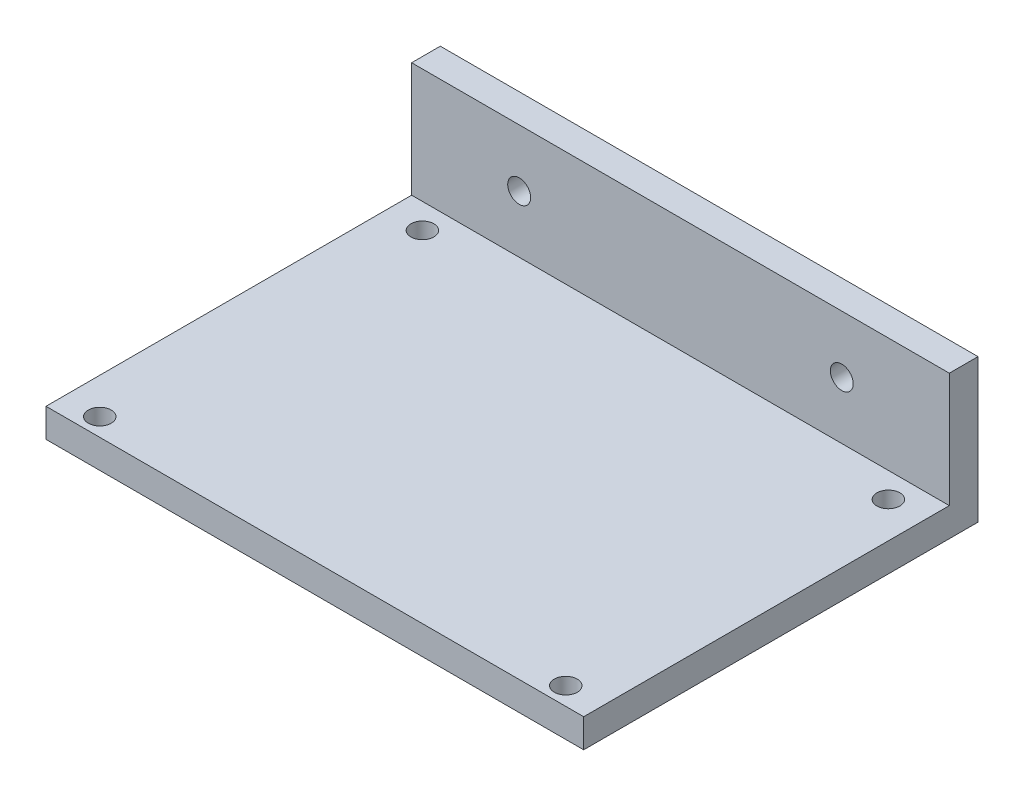
ISO-10303-21;
HEADER;
FILE_DESCRIPTION(('STEP AP214'),'2;1');
FILE_NAME('part.step','',(''),(''),'','','');
FILE_SCHEMA(('AUTOMOTIVE_DESIGN { 1 0 10303 214 1 1 1 1 }'));
ENDSEC;
DATA;
#1=APPLICATION_CONTEXT('core data for automotive mechanical design processes');
#2=APPLICATION_PROTOCOL_DEFINITION('international standard','automotive_design',2000,#1);
#3=PRODUCT_CONTEXT('',#1,'mechanical');
#4=PRODUCT('Part','Part','',(#3));
#5=PRODUCT_RELATED_PRODUCT_CATEGORY('part','',(#4));
#6=PRODUCT_DEFINITION_FORMATION('','',#4);
#7=PRODUCT_DEFINITION_CONTEXT('part definition',#1,'design');
#8=PRODUCT_DEFINITION('design','',#6,#7);
#9=PRODUCT_DEFINITION_SHAPE('','',#8);
#10=(LENGTH_UNIT() NAMED_UNIT(*) SI_UNIT(.MILLI.,.METRE.));
#11=(NAMED_UNIT(*) PLANE_ANGLE_UNIT() SI_UNIT($,.RADIAN.));
#12=(NAMED_UNIT(*) SI_UNIT($,.STERADIAN.) SOLID_ANGLE_UNIT());
#13=UNCERTAINTY_MEASURE_WITH_UNIT(LENGTH_MEASURE(1.E-05),#10,'distance_accuracy_value','');
#14=(GEOMETRIC_REPRESENTATION_CONTEXT(3) GLOBAL_UNCERTAINTY_ASSIGNED_CONTEXT((#13)) GLOBAL_UNIT_ASSIGNED_CONTEXT((#10,
#11,#12)) REPRESENTATION_CONTEXT('',''));
#15=CARTESIAN_POINT('',(0.,0.,0.));
#16=DIRECTION('',(0.,0.,1.));
#17=DIRECTION('',(1.,0.,0.));
#18=AXIS2_PLACEMENT_3D('',#15,#16,#17);
#19=CARTESIAN_POINT('',(0.,20.,0.));
#20=DIRECTION('',(1.,0.,0.));
#21=DIRECTION('',(0.,0.,-1.));
#22=AXIS2_PLACEMENT_3D('',#19,#20,#21);
#23=PLANE('',#22);
#24=DIRECTION('',(0.,0.,-1.));
#25=VECTOR('',#24,1.);
#26=CARTESIAN_POINT('',(0.,4.,0.));
#27=LINE('',#26,#25);
#28=CARTESIAN_POINT('',(0.,4.,0.));
#29=VERTEX_POINT('',#28);
#30=CARTESIAN_POINT('',(0.,4.,-51.));
#31=VERTEX_POINT('',#30);
#32=EDGE_CURVE('E104',#29,#31,#27,.T.);
#33=ORIENTED_EDGE('',*,*,#32,.T.);
#34=DIRECTION('',(0.,1.,0.));
#35=VECTOR('',#34,1.);
#36=CARTESIAN_POINT('',(0.,20.,-51.));
#37=LINE('',#36,#35);
#38=CARTESIAN_POINT('',(0.,20.,-51.));
#39=VERTEX_POINT('',#38);
#40=EDGE_CURVE('E107',#31,#39,#37,.T.);
#41=ORIENTED_EDGE('',*,*,#40,.T.);
#42=DIRECTION('',(0.,0.,1.));
#43=VECTOR('',#42,1.);
#44=CARTESIAN_POINT('',(0.,20.,0.));
#45=LINE('',#44,#43);
#46=CARTESIAN_POINT('',(0.,20.,-55.));
#47=VERTEX_POINT('',#46);
#48=EDGE_CURVE('E90',#47,#39,#45,.T.);
#49=ORIENTED_EDGE('',*,*,#48,.F.);
#50=DIRECTION('',(0.,-1.,0.));
#51=VECTOR('',#50,1.);
#52=CARTESIAN_POINT('',(0.,20.,-55.));
#53=LINE('',#52,#51);
#54=CARTESIAN_POINT('',(0.,0.,-55.));
#55=VERTEX_POINT('',#54);
#56=EDGE_CURVE('E83',#47,#55,#53,.T.);
#57=ORIENTED_EDGE('',*,*,#56,.T.);
#58=DIRECTION('',(0.,0.,1.));
#59=VECTOR('',#58,1.);
#60=CARTESIAN_POINT('',(0.,0.,0.));
#61=LINE('',#60,#59);
#62=CARTESIAN_POINT('',(0.,0.,0.));
#63=VERTEX_POINT('',#62);
#64=EDGE_CURVE('E97',#55,#63,#61,.T.);
#65=ORIENTED_EDGE('',*,*,#64,.T.);
#66=DIRECTION('',(0.,-1.,0.));
#67=VECTOR('',#66,1.);
#68=CARTESIAN_POINT('',(0.,20.,0.));
#69=LINE('',#68,#67);
#70=EDGE_CURVE('E45',#29,#63,#69,.T.);
#71=ORIENTED_EDGE('',*,*,#70,.F.);
#72=EDGE_LOOP('',(#33,#41,#49,#57,#65,#71));
#73=FACE_BOUND('',#72,.T.);
#74=ADVANCED_FACE('F37',(#73),#23,.F.);
#75=CARTESIAN_POINT('',(0.,20.,0.));
#76=DIRECTION('',(0.,0.,-1.));
#77=DIRECTION('',(-1.,0.,0.));
#78=AXIS2_PLACEMENT_3D('',#75,#76,#77);
#79=PLANE('',#78);
#80=DIRECTION('',(0.,-1.,0.));
#81=VECTOR('',#80,1.);
#82=CARTESIAN_POINT('',(75.,20.,0.));
#83=LINE('',#82,#81);
#84=CARTESIAN_POINT('',(75.,4.,0.));
#85=VERTEX_POINT('',#84);
#86=CARTESIAN_POINT('',(75.,0.,0.));
#87=VERTEX_POINT('',#86);
#88=EDGE_CURVE('E114',#85,#87,#83,.T.);
#89=ORIENTED_EDGE('',*,*,#88,.F.);
#90=DIRECTION('',(1.,0.,0.));
#91=VECTOR('',#90,1.);
#92=CARTESIAN_POINT('',(-19.,4.,0.));
#93=LINE('',#92,#91);
#94=EDGE_CURVE('E150',#29,#85,#93,.T.);
#95=ORIENTED_EDGE('',*,*,#94,.F.);
#96=ORIENTED_EDGE('',*,*,#70,.T.);
#97=DIRECTION('',(1.,0.,0.));
#98=VECTOR('',#97,1.);
#99=CARTESIAN_POINT('',(0.,0.,0.));
#100=LINE('',#99,#98);
#101=EDGE_CURVE('E103',#63,#87,#100,.T.);
#102=ORIENTED_EDGE('',*,*,#101,.T.);
#103=EDGE_LOOP('',(#89,#95,#96,#102));
#104=FACE_BOUND('',#103,.T.);
#105=ADVANCED_FACE('F166',(#104),#79,.F.);
#106=CARTESIAN_POINT('',(75.,20.,0.));
#107=DIRECTION('',(-1.,0.,0.));
#108=DIRECTION('',(0.,0.,1.));
#109=AXIS2_PLACEMENT_3D('',#106,#107,#108);
#110=PLANE('',#109);
#111=DIRECTION('',(0.,0.,-1.));
#112=VECTOR('',#111,1.);
#113=CARTESIAN_POINT('',(75.,20.,0.));
#114=LINE('',#113,#112);
#115=CARTESIAN_POINT('',(75.,20.,-51.));
#116=VERTEX_POINT('',#115);
#117=CARTESIAN_POINT('',(75.,20.,-55.));
#118=VERTEX_POINT('',#117);
#119=EDGE_CURVE('E156',#116,#118,#114,.T.);
#120=ORIENTED_EDGE('',*,*,#119,.F.);
#121=DIRECTION('',(0.,1.,0.));
#122=VECTOR('',#121,1.);
#123=CARTESIAN_POINT('',(75.,20.,-51.));
#124=LINE('',#123,#122);
#125=CARTESIAN_POINT('',(75.,4.,-51.));
#126=VERTEX_POINT('',#125);
#127=EDGE_CURVE('E53',#126,#116,#124,.T.);
#128=ORIENTED_EDGE('',*,*,#127,.F.);
#129=DIRECTION('',(0.,0.,-1.));
#130=VECTOR('',#129,1.);
#131=CARTESIAN_POINT('',(75.,4.,0.));
#132=LINE('',#131,#130);
#133=EDGE_CURVE('E124',#85,#126,#132,.T.);
#134=ORIENTED_EDGE('',*,*,#133,.F.);
#135=ORIENTED_EDGE('',*,*,#88,.T.);
#136=DIRECTION('',(0.,0.,-1.));
#137=VECTOR('',#136,1.);
#138=CARTESIAN_POINT('',(75.,0.,0.));
#139=LINE('',#138,#137);
#140=CARTESIAN_POINT('',(75.,0.,-55.));
#141=VERTEX_POINT('',#140);
#142=EDGE_CURVE('E91',#87,#141,#139,.T.);
#143=ORIENTED_EDGE('',*,*,#142,.T.);
#144=DIRECTION('',(0.,-1.,0.));
#145=VECTOR('',#144,1.);
#146=CARTESIAN_POINT('',(75.,20.,-55.));
#147=LINE('',#146,#145);
#148=EDGE_CURVE('E86',#118,#141,#147,.T.);
#149=ORIENTED_EDGE('',*,*,#148,.F.);
#150=EDGE_LOOP('',(#120,#128,#134,#135,#143,#149));
#151=FACE_BOUND('',#150,.T.);
#152=ADVANCED_FACE('F160',(#151),#110,.F.);
#153=CARTESIAN_POINT('',(0.,20.,-55.));
#154=DIRECTION('',(0.,0.,1.));
#155=DIRECTION('',(1.,0.,0.));
#156=AXIS2_PLACEMENT_3D('',#153,#154,#155);
#157=PLANE('',#156);
#158=CARTESIAN_POINT('',(60.,12.,-55.));
#159=DIRECTION('',(0.,0.,-1.));
#160=DIRECTION('',(-1.,0.,0.));
#161=AXIS2_PLACEMENT_3D('',#158,#159,#160);
#162=CIRCLE('',#161,1.6);
#163=CARTESIAN_POINT('',(58.4,12.,-55.));
#164=VERTEX_POINT('',#163);
#165=EDGE_CURVE('E121',#164,#164,#162,.T.);
#166=ORIENTED_EDGE('',*,*,#165,.F.);
#167=EDGE_LOOP('',(#166));
#168=FACE_BOUND('',#167,.T.);
#169=CARTESIAN_POINT('',(15.,12.,-55.));
#170=DIRECTION('',(0.,0.,-1.));
#171=DIRECTION('',(-1.,0.,0.));
#172=AXIS2_PLACEMENT_3D('',#169,#170,#171);
#173=CIRCLE('',#172,1.6);
#174=CARTESIAN_POINT('',(13.4,12.,-55.));
#175=VERTEX_POINT('',#174);
#176=EDGE_CURVE('E136',#175,#175,#173,.T.);
#177=ORIENTED_EDGE('',*,*,#176,.F.);
#178=EDGE_LOOP('',(#177));
#179=FACE_BOUND('',#178,.T.);
#180=DIRECTION('',(-1.,0.,0.));
#181=VECTOR('',#180,1.);
#182=CARTESIAN_POINT('',(0.,0.,-55.));
#183=LINE('',#182,#181);
#184=EDGE_CURVE('E80',#141,#55,#183,.T.);
#185=ORIENTED_EDGE('',*,*,#184,.T.);
#186=ORIENTED_EDGE('',*,*,#56,.F.);
#187=DIRECTION('',(-1.,0.,0.));
#188=VECTOR('',#187,1.);
#189=CARTESIAN_POINT('',(0.,20.,-55.));
#190=LINE('',#189,#188);
#191=EDGE_CURVE('E61',#118,#47,#190,.T.);
#192=ORIENTED_EDGE('',*,*,#191,.F.);
#193=ORIENTED_EDGE('',*,*,#148,.T.);
#194=EDGE_LOOP('',(#185,#186,#192,#193));
#195=FACE_BOUND('',#194,.T.);
#196=ADVANCED_FACE('F82',(#168,#179,#195),#157,.F.);
#197=CARTESIAN_POINT('',(0.,20.,0.));
#198=DIRECTION('',(0.,-1.,0.));
#199=DIRECTION('',(0.,0.,-1.));
#200=AXIS2_PLACEMENT_3D('',#197,#198,#199);
#201=PLANE('',#200);
#202=ORIENTED_EDGE('',*,*,#48,.T.);
#203=DIRECTION('',(1.,0.,0.));
#204=VECTOR('',#203,1.);
#205=CARTESIAN_POINT('',(0.,20.,-51.));
#206=LINE('',#205,#204);
#207=EDGE_CURVE('E11',#39,#116,#206,.T.);
#208=ORIENTED_EDGE('',*,*,#207,.T.);
#209=ORIENTED_EDGE('',*,*,#119,.T.);
#210=ORIENTED_EDGE('',*,*,#191,.T.);
#211=EDGE_LOOP('',(#202,#208,#209,#210));
#212=FACE_BOUND('',#211,.T.);
#213=ADVANCED_FACE('F158',(#212),#201,.F.);
#214=CARTESIAN_POINT('',(0.,0.,0.));
#215=DIRECTION('',(0.,-1.,0.));
#216=DIRECTION('',(0.,0.,-1.));
#217=AXIS2_PLACEMENT_3D('',#214,#215,#216);
#218=PLANE('',#217);
#219=CARTESIAN_POINT('',(70.,0.,-2.5));
#220=DIRECTION('',(0.,-1.,0.));
#221=DIRECTION('',(0.,0.,-1.));
#222=AXIS2_PLACEMENT_3D('',#219,#220,#221);
#223=CIRCLE('',#222,1.60000000000001);
#224=CARTESIAN_POINT('',(70.,0.,-4.10000000000001));
#225=VERTEX_POINT('',#224);
#226=EDGE_CURVE('E312',#225,#225,#223,.T.);
#227=ORIENTED_EDGE('',*,*,#226,.F.);
#228=EDGE_LOOP('',(#227));
#229=FACE_BOUND('',#228,.T.);
#230=CARTESIAN_POINT('',(70.,0.,-47.5));
#231=DIRECTION('',(0.,-1.,0.));
#232=DIRECTION('',(0.,0.,-1.));
#233=AXIS2_PLACEMENT_3D('',#230,#231,#232);
#234=CIRCLE('',#233,1.60000000000001);
#235=CARTESIAN_POINT('',(70.,0.,-49.1));
#236=VERTEX_POINT('',#235);
#237=EDGE_CURVE('E313',#236,#236,#234,.T.);
#238=ORIENTED_EDGE('',*,*,#237,.F.);
#239=EDGE_LOOP('',(#238));
#240=FACE_BOUND('',#239,.T.);
#241=CARTESIAN_POINT('',(5.,0.,-47.5));
#242=DIRECTION('',(0.,-1.,0.));
#243=DIRECTION('',(0.,0.,-1.));
#244=AXIS2_PLACEMENT_3D('',#241,#242,#243);
#245=CIRCLE('',#244,1.6);
#246=CARTESIAN_POINT('',(5.,0.,-49.1));
#247=VERTEX_POINT('',#246);
#248=EDGE_CURVE('E316',#247,#247,#245,.T.);
#249=ORIENTED_EDGE('',*,*,#248,.F.);
#250=EDGE_LOOP('',(#249));
#251=FACE_BOUND('',#250,.T.);
#252=CARTESIAN_POINT('',(5.,0.,-2.5));
#253=DIRECTION('',(0.,-1.,0.));
#254=DIRECTION('',(0.,0.,-1.));
#255=AXIS2_PLACEMENT_3D('',#252,#253,#254);
#256=CIRCLE('',#255,1.6);
#257=CARTESIAN_POINT('',(5.,0.,-4.1));
#258=VERTEX_POINT('',#257);
#259=EDGE_CURVE('E129',#258,#258,#256,.T.);
#260=ORIENTED_EDGE('',*,*,#259,.F.);
#261=EDGE_LOOP('',(#260));
#262=FACE_BOUND('',#261,.T.);
#263=ORIENTED_EDGE('',*,*,#64,.F.);
#264=ORIENTED_EDGE('',*,*,#184,.F.);
#265=ORIENTED_EDGE('',*,*,#142,.F.);
#266=ORIENTED_EDGE('',*,*,#101,.F.);
#267=EDGE_LOOP('',(#263,#264,#265,#266));
#268=FACE_BOUND('',#267,.T.);
#269=ADVANCED_FACE('F101',(#229,#240,#251,#262,#268),#218,.T.);
#270=CARTESIAN_POINT('',(-19.,4.,0.));
#271=DIRECTION('',(0.,-1.,0.));
#272=DIRECTION('',(0.,0.,-1.));
#273=AXIS2_PLACEMENT_3D('',#270,#271,#272);
#274=PLANE('',#273);
#275=CARTESIAN_POINT('',(70.,4.,-2.5));
#276=DIRECTION('',(0.,-1.,0.));
#277=DIRECTION('',(0.,0.,-1.));
#278=AXIS2_PLACEMENT_3D('',#275,#276,#277);
#279=CIRCLE('',#278,1.60000000000001);
#280=CARTESIAN_POINT('',(70.,4.,-4.10000000000001));
#281=VERTEX_POINT('',#280);
#282=EDGE_CURVE('E40',#281,#281,#279,.T.);
#283=ORIENTED_EDGE('',*,*,#282,.T.);
#284=EDGE_LOOP('',(#283));
#285=FACE_BOUND('',#284,.T.);
#286=CARTESIAN_POINT('',(70.,4.,-47.5));
#287=DIRECTION('',(0.,-1.,0.));
#288=DIRECTION('',(0.,0.,-1.));
#289=AXIS2_PLACEMENT_3D('',#286,#287,#288);
#290=CIRCLE('',#289,1.60000000000001);
#291=CARTESIAN_POINT('',(70.,4.,-49.1));
#292=VERTEX_POINT('',#291);
#293=EDGE_CURVE('E131',#292,#292,#290,.T.);
#294=ORIENTED_EDGE('',*,*,#293,.T.);
#295=EDGE_LOOP('',(#294));
#296=FACE_BOUND('',#295,.T.);
#297=CARTESIAN_POINT('',(5.,4.,-47.5));
#298=DIRECTION('',(0.,-1.,0.));
#299=DIRECTION('',(0.,0.,-1.));
#300=AXIS2_PLACEMENT_3D('',#297,#298,#299);
#301=CIRCLE('',#300,1.6);
#302=CARTESIAN_POINT('',(5.,4.,-49.1));
#303=VERTEX_POINT('',#302);
#304=EDGE_CURVE('E128',#303,#303,#301,.T.);
#305=ORIENTED_EDGE('',*,*,#304,.T.);
#306=EDGE_LOOP('',(#305));
#307=FACE_BOUND('',#306,.T.);
#308=CARTESIAN_POINT('',(5.,4.,-2.5));
#309=DIRECTION('',(0.,-1.,0.));
#310=DIRECTION('',(0.,0.,-1.));
#311=AXIS2_PLACEMENT_3D('',#308,#309,#310);
#312=CIRCLE('',#311,1.6);
#313=CARTESIAN_POINT('',(5.,4.,-4.1));
#314=VERTEX_POINT('',#313);
#315=EDGE_CURVE('E125',#314,#314,#312,.T.);
#316=ORIENTED_EDGE('',*,*,#315,.T.);
#317=EDGE_LOOP('',(#316));
#318=FACE_BOUND('',#317,.T.);
#319=ORIENTED_EDGE('',*,*,#94,.T.);
#320=ORIENTED_EDGE('',*,*,#133,.T.);
#321=DIRECTION('',(1.,0.,0.));
#322=VECTOR('',#321,1.);
#323=CARTESIAN_POINT('',(-19.,4.,-51.));
#324=LINE('',#323,#322);
#325=EDGE_CURVE('E151',#31,#126,#324,.T.);
#326=ORIENTED_EDGE('',*,*,#325,.F.);
#327=ORIENTED_EDGE('',*,*,#32,.F.);
#328=EDGE_LOOP('',(#319,#320,#326,#327));
#329=FACE_BOUND('',#328,.T.);
#330=ADVANCED_FACE('F178',(#285,#296,#307,#318,#329),#274,.F.);
#331=CARTESIAN_POINT('',(-19.,20.,-51.));
#332=DIRECTION('',(0.,0.,-1.));
#333=DIRECTION('',(-1.,0.,0.));
#334=AXIS2_PLACEMENT_3D('',#331,#332,#333);
#335=PLANE('',#334);
#336=CARTESIAN_POINT('',(60.,12.,-51.));
#337=DIRECTION('',(0.,0.,-1.));
#338=DIRECTION('',(-1.,0.,0.));
#339=AXIS2_PLACEMENT_3D('',#336,#337,#338);
#340=CIRCLE('',#339,1.6);
#341=CARTESIAN_POINT('',(58.4,12.,-51.));
#342=VERTEX_POINT('',#341);
#343=EDGE_CURVE('E120',#342,#342,#340,.T.);
#344=ORIENTED_EDGE('',*,*,#343,.T.);
#345=EDGE_LOOP('',(#344));
#346=FACE_BOUND('',#345,.T.);
#347=CARTESIAN_POINT('',(15.,12.,-51.));
#348=DIRECTION('',(0.,0.,-1.));
#349=DIRECTION('',(-1.,0.,0.));
#350=AXIS2_PLACEMENT_3D('',#347,#348,#349);
#351=CIRCLE('',#350,1.6);
#352=CARTESIAN_POINT('',(13.4,12.,-51.));
#353=VERTEX_POINT('',#352);
#354=EDGE_CURVE('E117',#353,#353,#351,.T.);
#355=ORIENTED_EDGE('',*,*,#354,.T.);
#356=EDGE_LOOP('',(#355));
#357=FACE_BOUND('',#356,.T.);
#358=ORIENTED_EDGE('',*,*,#325,.T.);
#359=ORIENTED_EDGE('',*,*,#127,.T.);
#360=ORIENTED_EDGE('',*,*,#207,.F.);
#361=ORIENTED_EDGE('',*,*,#40,.F.);
#362=EDGE_LOOP('',(#358,#359,#360,#361));
#363=FACE_BOUND('',#362,.T.);
#364=ADVANCED_FACE('F179',(#346,#357,#363),#335,.F.);
#365=CARTESIAN_POINT('',(15.,12.,-0.999999999999973));
#366=DIRECTION('',(0.,0.,-1.));
#367=DIRECTION('',(-1.,0.,0.));
#368=AXIS2_PLACEMENT_3D('',#365,#366,#367);
#369=CYLINDRICAL_SURFACE('',#368,1.6);
#370=ORIENTED_EDGE('',*,*,#176,.T.);
#371=EDGE_LOOP('',(#370));
#372=FACE_BOUND('',#371,.T.);
#373=ORIENTED_EDGE('',*,*,#354,.F.);
#374=EDGE_LOOP('',(#373));
#375=FACE_BOUND('',#374,.T.);
#376=ADVANCED_FACE('F181',(#372,#375),#369,.F.);
#377=CARTESIAN_POINT('',(60.,12.,-0.999999999999973));
#378=DIRECTION('',(0.,0.,-1.));
#379=DIRECTION('',(-1.,0.,0.));
#380=AXIS2_PLACEMENT_3D('',#377,#378,#379);
#381=CYLINDRICAL_SURFACE('',#380,1.6);
#382=ORIENTED_EDGE('',*,*,#165,.T.);
#383=EDGE_LOOP('',(#382));
#384=FACE_BOUND('',#383,.T.);
#385=ORIENTED_EDGE('',*,*,#343,.F.);
#386=EDGE_LOOP('',(#385));
#387=FACE_BOUND('',#386,.T.);
#388=ADVANCED_FACE('F188',(#384,#387),#381,.F.);
#389=CARTESIAN_POINT('',(5.,10.,-2.5));
#390=DIRECTION('',(0.,-1.,0.));
#391=DIRECTION('',(0.,0.,-1.));
#392=AXIS2_PLACEMENT_3D('',#389,#390,#391);
#393=CYLINDRICAL_SURFACE('',#392,1.6);
#394=ORIENTED_EDGE('',*,*,#259,.T.);
#395=EDGE_LOOP('',(#394));
#396=FACE_BOUND('',#395,.T.);
#397=ORIENTED_EDGE('',*,*,#315,.F.);
#398=EDGE_LOOP('',(#397));
#399=FACE_BOUND('',#398,.T.);
#400=ADVANCED_FACE('F228',(#396,#399),#393,.F.);
#401=CARTESIAN_POINT('',(5.,10.,-47.5));
#402=DIRECTION('',(0.,-1.,0.));
#403=DIRECTION('',(0.,0.,-1.));
#404=AXIS2_PLACEMENT_3D('',#401,#402,#403);
#405=CYLINDRICAL_SURFACE('',#404,1.6);
#406=ORIENTED_EDGE('',*,*,#248,.T.);
#407=EDGE_LOOP('',(#406));
#408=FACE_BOUND('',#407,.T.);
#409=ORIENTED_EDGE('',*,*,#304,.F.);
#410=EDGE_LOOP('',(#409));
#411=FACE_BOUND('',#410,.T.);
#412=ADVANCED_FACE('F233',(#408,#411),#405,.F.);
#413=CARTESIAN_POINT('',(70.,10.,-47.5));
#414=DIRECTION('',(0.,-1.,0.));
#415=DIRECTION('',(0.,0.,-1.));
#416=AXIS2_PLACEMENT_3D('',#413,#414,#415);
#417=CYLINDRICAL_SURFACE('',#416,1.60000000000001);
#418=ORIENTED_EDGE('',*,*,#237,.T.);
#419=EDGE_LOOP('',(#418));
#420=FACE_BOUND('',#419,.T.);
#421=ORIENTED_EDGE('',*,*,#293,.F.);
#422=EDGE_LOOP('',(#421));
#423=FACE_BOUND('',#422,.T.);
#424=ADVANCED_FACE('F245',(#420,#423),#417,.F.);
#425=CARTESIAN_POINT('',(70.,10.,-2.5));
#426=DIRECTION('',(0.,-1.,0.));
#427=DIRECTION('',(0.,0.,-1.));
#428=AXIS2_PLACEMENT_3D('',#425,#426,#427);
#429=CYLINDRICAL_SURFACE('',#428,1.60000000000001);
#430=ORIENTED_EDGE('',*,*,#226,.T.);
#431=EDGE_LOOP('',(#430));
#432=FACE_BOUND('',#431,.T.);
#433=ORIENTED_EDGE('',*,*,#282,.F.);
#434=EDGE_LOOP('',(#433));
#435=FACE_BOUND('',#434,.T.);
#436=ADVANCED_FACE('F255',(#432,#435),#429,.F.);
#437=CLOSED_SHELL('',(#74,#105,#152,#196,#213,#269,#330,#364,#376,#388,#400,#412,#424,#436));
#438=MANIFOLD_SOLID_BREP('B2',#437);
#439=ADVANCED_BREP_SHAPE_REPRESENTATION('',(#18,#438),#14);
#440=SHAPE_DEFINITION_REPRESENTATION(#9,#439);
ENDSEC;
END-ISO-10303-21;
